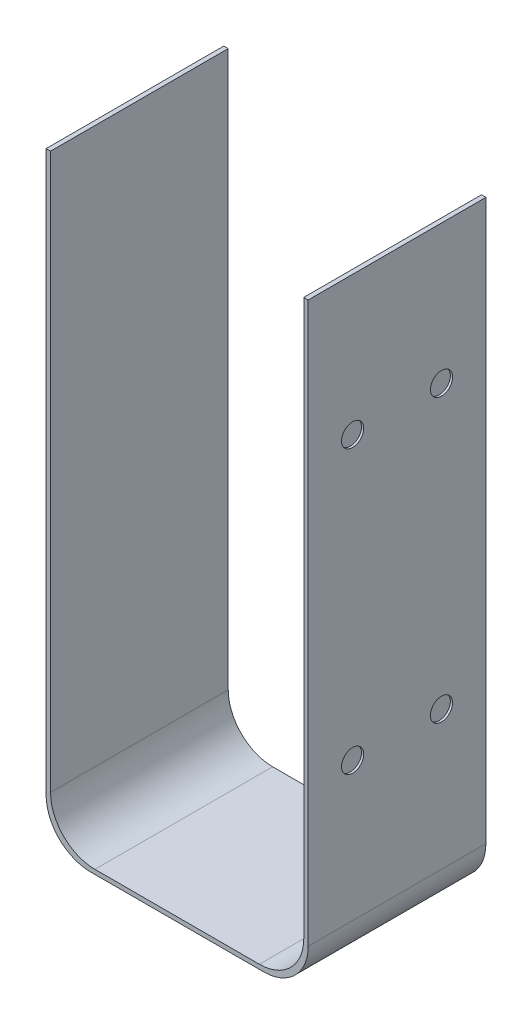
ISO-10303-21;
HEADER;
FILE_DESCRIPTION(('STEP AP214'),'2;1');
FILE_NAME('part.step','',(''),(''),'','','');
FILE_SCHEMA(('AUTOMOTIVE_DESIGN { 1 0 10303 214 1 1 1 1 }'));
ENDSEC;
DATA;
#1=APPLICATION_CONTEXT('core data for automotive mechanical design processes');
#2=APPLICATION_PROTOCOL_DEFINITION('international standard','automotive_design',2000,#1);
#3=PRODUCT_CONTEXT('',#1,'mechanical');
#4=PRODUCT('Part','Part','',(#3));
#5=PRODUCT_RELATED_PRODUCT_CATEGORY('part','',(#4));
#6=PRODUCT_DEFINITION_FORMATION('','',#4);
#7=PRODUCT_DEFINITION_CONTEXT('part definition',#1,'design');
#8=PRODUCT_DEFINITION('design','',#6,#7);
#9=PRODUCT_DEFINITION_SHAPE('','',#8);
#10=(LENGTH_UNIT() NAMED_UNIT(*) SI_UNIT(.MILLI.,.METRE.));
#11=(NAMED_UNIT(*) PLANE_ANGLE_UNIT() SI_UNIT($,.RADIAN.));
#12=(NAMED_UNIT(*) SI_UNIT($,.STERADIAN.) SOLID_ANGLE_UNIT());
#13=UNCERTAINTY_MEASURE_WITH_UNIT(LENGTH_MEASURE(1.E-05),#10,'distance_accuracy_value','');
#14=(GEOMETRIC_REPRESENTATION_CONTEXT(3) GLOBAL_UNCERTAINTY_ASSIGNED_CONTEXT((#13)) GLOBAL_UNIT_ASSIGNED_CONTEXT((#10,
#11,#12)) REPRESENTATION_CONTEXT('',''));
#15=CARTESIAN_POINT('',(0.,0.,0.));
#16=DIRECTION('',(0.,0.,1.));
#17=DIRECTION('',(1.,0.,0.));
#18=AXIS2_PLACEMENT_3D('',#15,#16,#17);
#19=CARTESIAN_POINT('',(-55.8801317233809,42.8642857142857,8.));
#20=DIRECTION('',(0.,-1.,0.));
#21=DIRECTION('',(0.,0.,-1.));
#22=AXIS2_PLACEMENT_3D('',#19,#20,#21);
#23=PLANE('',#22);
#24=DIRECTION('',(-1.,0.,0.));
#25=VECTOR('',#24,1.);
#26=CARTESIAN_POINT('',(-55.8801317233809,42.8642857142857,0.));
#27=LINE('',#26,#25);
#28=CARTESIAN_POINT('',(-55.6801317233809,42.8642857142857,0.));
#29=VERTEX_POINT('',#28);
#30=CARTESIAN_POINT('',(-55.8801317233809,42.8642857142857,0.));
#31=VERTEX_POINT('',#30);
#32=EDGE_CURVE('E153',#29,#31,#27,.T.);
#33=ORIENTED_EDGE('',*,*,#32,.T.);
#34=DIRECTION('',(0.,0.,-1.));
#35=VECTOR('',#34,1.);
#36=CARTESIAN_POINT('',(-55.8801317233809,42.8642857142857,8.));
#37=LINE('',#36,#35);
#38=CARTESIAN_POINT('',(-55.8801317233809,42.8642857142857,8.));
#39=VERTEX_POINT('',#38);
#40=EDGE_CURVE('E11',#39,#31,#37,.T.);
#41=ORIENTED_EDGE('',*,*,#40,.F.);
#42=DIRECTION('',(-1.,0.,0.));
#43=VECTOR('',#42,1.);
#44=CARTESIAN_POINT('',(-55.8801317233809,42.8642857142857,8.));
#45=LINE('',#44,#43);
#46=CARTESIAN_POINT('',(-55.6801317233809,42.8642857142857,8.));
#47=VERTEX_POINT('',#46);
#48=EDGE_CURVE('E176',#47,#39,#45,.T.);
#49=ORIENTED_EDGE('',*,*,#48,.F.);
#50=DIRECTION('',(0.,0.,-1.));
#51=VECTOR('',#50,1.);
#52=CARTESIAN_POINT('',(-55.6801317233809,42.8642857142857,8.));
#53=LINE('',#52,#51);
#54=EDGE_CURVE('E149',#47,#29,#53,.T.);
#55=ORIENTED_EDGE('',*,*,#54,.T.);
#56=EDGE_LOOP('',(#33,#41,#49,#55));
#57=FACE_BOUND('',#56,.T.);
#58=ADVANCED_FACE('F33',(#57),#23,.F.);
#59=CARTESIAN_POINT('',(-55.8801317233809,17.6642857142858,8.));
#60=DIRECTION('',(1.,0.,0.));
#61=DIRECTION('',(0.,0.,-1.));
#62=AXIS2_PLACEMENT_3D('',#59,#60,#61);
#63=PLANE('',#62);
#64=CARTESIAN_POINT('',(-55.8801317233809,36.6142857142857,6.));
#65=DIRECTION('',(-1.,0.,0.));
#66=DIRECTION('',(0.,0.,-1.));
#67=AXIS2_PLACEMENT_3D('',#64,#65,#66);
#68=CIRCLE('',#67,0.500000000000003);
#69=CARTESIAN_POINT('',(-55.8801317233809,36.6142857142857,5.5));
#70=VERTEX_POINT('',#69);
#71=EDGE_CURVE('E490',#70,#70,#68,.T.);
#72=ORIENTED_EDGE('',*,*,#71,.F.);
#73=EDGE_LOOP('',(#72));
#74=FACE_BOUND('',#73,.T.);
#75=CARTESIAN_POINT('',(-55.8801317233809,23.9142857142857,2.));
#76=DIRECTION('',(-1.,0.,0.));
#77=DIRECTION('',(0.,0.,-1.));
#78=AXIS2_PLACEMENT_3D('',#75,#76,#77);
#79=CIRCLE('',#78,0.500000000000003);
#80=CARTESIAN_POINT('',(-55.8801317233809,23.9142857142857,1.5));
#81=VERTEX_POINT('',#80);
#82=EDGE_CURVE('E489',#81,#81,#79,.T.);
#83=ORIENTED_EDGE('',*,*,#82,.F.);
#84=EDGE_LOOP('',(#83));
#85=FACE_BOUND('',#84,.T.);
#86=CARTESIAN_POINT('',(-55.8801317233809,23.9142857142857,6.));
#87=DIRECTION('',(-1.,0.,0.));
#88=DIRECTION('',(0.,0.,1.));
#89=AXIS2_PLACEMENT_3D('',#86,#87,#88);
#90=CIRCLE('',#89,0.500000000000003);
#91=CARTESIAN_POINT('',(-55.8801317233809,23.9142857142857,6.5));
#92=VERTEX_POINT('',#91);
#93=EDGE_CURVE('E551',#92,#92,#90,.T.);
#94=ORIENTED_EDGE('',*,*,#93,.F.);
#95=EDGE_LOOP('',(#94));
#96=FACE_BOUND('',#95,.T.);
#97=CARTESIAN_POINT('',(-55.8801317233809,36.6142857142857,2.));
#98=DIRECTION('',(-1.,0.,0.));
#99=DIRECTION('',(0.,0.,1.));
#100=AXIS2_PLACEMENT_3D('',#97,#98,#99);
#101=CIRCLE('',#100,0.500000000000003);
#102=CARTESIAN_POINT('',(-55.8801317233809,36.6142857142857,2.5));
#103=VERTEX_POINT('',#102);
#104=EDGE_CURVE('E503',#103,#103,#101,.T.);
#105=ORIENTED_EDGE('',*,*,#104,.F.);
#106=EDGE_LOOP('',(#105));
#107=FACE_BOUND('',#106,.T.);
#108=DIRECTION('',(0.,-1.,0.));
#109=VECTOR('',#108,1.);
#110=CARTESIAN_POINT('',(-55.8801317233809,17.6642857142858,0.));
#111=LINE('',#110,#109);
#112=CARTESIAN_POINT('',(-55.8801317233809,17.6642857142857,0.));
#113=VERTEX_POINT('',#112);
#114=EDGE_CURVE('E156',#31,#113,#111,.T.);
#115=ORIENTED_EDGE('',*,*,#114,.T.);
#116=DIRECTION('',(0.,0.,-1.));
#117=VECTOR('',#116,1.);
#118=CARTESIAN_POINT('',(-55.8801317233809,17.6642857142857,8.));
#119=LINE('',#118,#117);
#120=CARTESIAN_POINT('',(-55.8801317233809,17.6642857142857,8.));
#121=VERTEX_POINT('',#120);
#122=EDGE_CURVE('E41',#121,#113,#119,.T.);
#123=ORIENTED_EDGE('',*,*,#122,.F.);
#124=DIRECTION('',(0.,-1.,0.));
#125=VECTOR('',#124,1.);
#126=CARTESIAN_POINT('',(-55.8801317233809,17.6642857142858,8.));
#127=LINE('',#126,#125);
#128=EDGE_CURVE('E104',#39,#121,#127,.T.);
#129=ORIENTED_EDGE('',*,*,#128,.F.);
#130=ORIENTED_EDGE('',*,*,#40,.T.);
#131=EDGE_LOOP('',(#115,#123,#129,#130));
#132=FACE_BOUND('',#131,.T.);
#133=ADVANCED_FACE('F254',(#74,#85,#96,#107,#132),#63,.F.);
#134=CARTESIAN_POINT('',(-53.8801317233809,17.6642857142857,8.));
#135=DIRECTION('',(0.,0.,-1.));
#136=DIRECTION('',(-1.,0.,0.));
#137=AXIS2_PLACEMENT_3D('',#134,#135,#136);
#138=CYLINDRICAL_SURFACE('',#137,2.);
#139=CARTESIAN_POINT('',(-53.8801317233809,17.6642857142857,0.));
#140=DIRECTION('',(0.,0.,1.));
#141=DIRECTION('',(-1.,0.,0.));
#142=AXIS2_PLACEMENT_3D('',#139,#140,#141);
#143=CIRCLE('',#142,2.);
#144=CARTESIAN_POINT('',(-53.8801317233809,15.6642857142857,0.));
#145=VERTEX_POINT('',#144);
#146=EDGE_CURVE('E159',#113,#145,#143,.T.);
#147=ORIENTED_EDGE('',*,*,#146,.T.);
#148=DIRECTION('',(0.,0.,-1.));
#149=VECTOR('',#148,1.);
#150=CARTESIAN_POINT('',(-53.8801317233809,15.6642857142857,8.));
#151=LINE('',#150,#149);
#152=CARTESIAN_POINT('',(-53.8801317233809,15.6642857142857,8.));
#153=VERTEX_POINT('',#152);
#154=EDGE_CURVE('E195',#153,#145,#151,.T.);
#155=ORIENTED_EDGE('',*,*,#154,.F.);
#156=CARTESIAN_POINT('',(-53.8801317233809,17.6642857142857,8.));
#157=DIRECTION('',(0.,0.,1.));
#158=DIRECTION('',(-1.,0.,0.));
#159=AXIS2_PLACEMENT_3D('',#156,#157,#158);
#160=CIRCLE('',#159,2.);
#161=EDGE_CURVE('E203',#121,#153,#160,.T.);
#162=ORIENTED_EDGE('',*,*,#161,.F.);
#163=ORIENTED_EDGE('',*,*,#122,.T.);
#164=EDGE_LOOP('',(#147,#155,#162,#163));
#165=FACE_BOUND('',#164,.T.);
#166=ADVANCED_FACE('F201',(#165),#138,.T.);
#167=CARTESIAN_POINT('',(-46.0801317233809,15.6642857142857,8.));
#168=DIRECTION('',(0.,1.,0.));
#169=DIRECTION('',(0.,0.,1.));
#170=AXIS2_PLACEMENT_3D('',#167,#168,#169);
#171=PLANE('',#170);
#172=DIRECTION('',(1.,0.,0.));
#173=VECTOR('',#172,1.);
#174=CARTESIAN_POINT('',(-46.0801317233809,15.6642857142857,0.));
#175=LINE('',#174,#173);
#176=CARTESIAN_POINT('',(-46.0801317233809,15.6642857142857,0.));
#177=VERTEX_POINT('',#176);
#178=EDGE_CURVE('E161',#145,#177,#175,.T.);
#179=ORIENTED_EDGE('',*,*,#178,.T.);
#180=DIRECTION('',(0.,0.,-1.));
#181=VECTOR('',#180,1.);
#182=CARTESIAN_POINT('',(-46.0801317233809,15.6642857142857,8.));
#183=LINE('',#182,#181);
#184=CARTESIAN_POINT('',(-46.0801317233809,15.6642857142857,8.));
#185=VERTEX_POINT('',#184);
#186=EDGE_CURVE('E192',#185,#177,#183,.T.);
#187=ORIENTED_EDGE('',*,*,#186,.F.);
#188=DIRECTION('',(1.,0.,0.));
#189=VECTOR('',#188,1.);
#190=CARTESIAN_POINT('',(-46.0801317233809,15.6642857142857,8.));
#191=LINE('',#190,#189);
#192=EDGE_CURVE('E221',#153,#185,#191,.T.);
#193=ORIENTED_EDGE('',*,*,#192,.F.);
#194=ORIENTED_EDGE('',*,*,#154,.T.);
#195=EDGE_LOOP('',(#179,#187,#193,#194));
#196=FACE_BOUND('',#195,.T.);
#197=ADVANCED_FACE('F212',(#196),#171,.F.);
#198=CARTESIAN_POINT('',(-46.0801317233809,17.6642857142857,8.));
#199=DIRECTION('',(0.,0.,-1.));
#200=DIRECTION('',(-1.,0.,0.));
#201=AXIS2_PLACEMENT_3D('',#198,#199,#200);
#202=CYLINDRICAL_SURFACE('',#201,2.);
#203=CARTESIAN_POINT('',(-46.0801317233809,17.6642857142857,0.));
#204=DIRECTION('',(0.,0.,1.));
#205=DIRECTION('',(-1.,0.,0.));
#206=AXIS2_PLACEMENT_3D('',#203,#204,#205);
#207=CIRCLE('',#206,2.);
#208=CARTESIAN_POINT('',(-44.0801317233809,17.6642857142858,0.));
#209=VERTEX_POINT('',#208);
#210=EDGE_CURVE('E163',#177,#209,#207,.T.);
#211=ORIENTED_EDGE('',*,*,#210,.T.);
#212=DIRECTION('',(0.,0.,-1.));
#213=VECTOR('',#212,1.);
#214=CARTESIAN_POINT('',(-44.0801317233809,17.6642857142858,8.));
#215=LINE('',#214,#213);
#216=CARTESIAN_POINT('',(-44.0801317233809,17.6642857142858,8.));
#217=VERTEX_POINT('',#216);
#218=EDGE_CURVE('E189',#217,#209,#215,.T.);
#219=ORIENTED_EDGE('',*,*,#218,.F.);
#220=CARTESIAN_POINT('',(-46.0801317233809,17.6642857142857,8.));
#221=DIRECTION('',(0.,0.,1.));
#222=DIRECTION('',(-1.,0.,0.));
#223=AXIS2_PLACEMENT_3D('',#220,#221,#222);
#224=CIRCLE('',#223,2.);
#225=EDGE_CURVE('E218',#185,#217,#224,.T.);
#226=ORIENTED_EDGE('',*,*,#225,.F.);
#227=ORIENTED_EDGE('',*,*,#186,.T.);
#228=EDGE_LOOP('',(#211,#219,#226,#227));
#229=FACE_BOUND('',#228,.T.);
#230=ADVANCED_FACE('F216',(#229),#202,.T.);
#231=CARTESIAN_POINT('',(-44.0801317233809,42.8642857142857,8.));
#232=DIRECTION('',(-1.,0.,0.));
#233=DIRECTION('',(0.,0.,1.));
#234=AXIS2_PLACEMENT_3D('',#231,#232,#233);
#235=PLANE('',#234);
#236=CARTESIAN_POINT('',(-44.0801317233809,36.6142857142857,6.));
#237=DIRECTION('',(1.,0.,0.));
#238=DIRECTION('',(0.,0.,1.));
#239=AXIS2_PLACEMENT_3D('',#236,#237,#238);
#240=CIRCLE('',#239,0.500000000000001);
#241=CARTESIAN_POINT('',(-44.0801317233809,36.6142857142857,6.5));
#242=VERTEX_POINT('',#241);
#243=EDGE_CURVE('E502',#242,#242,#240,.T.);
#244=ORIENTED_EDGE('',*,*,#243,.F.);
#245=EDGE_LOOP('',(#244));
#246=FACE_BOUND('',#245,.T.);
#247=CARTESIAN_POINT('',(-44.0801317233809,23.9142857142857,2.));
#248=DIRECTION('',(1.,0.,0.));
#249=DIRECTION('',(0.,0.,1.));
#250=AXIS2_PLACEMENT_3D('',#247,#248,#249);
#251=CIRCLE('',#250,0.5);
#252=CARTESIAN_POINT('',(-44.0801317233809,23.9142857142857,2.5));
#253=VERTEX_POINT('',#252);
#254=EDGE_CURVE('E517',#253,#253,#251,.T.);
#255=ORIENTED_EDGE('',*,*,#254,.F.);
#256=EDGE_LOOP('',(#255));
#257=FACE_BOUND('',#256,.T.);
#258=CARTESIAN_POINT('',(-44.0801317233809,23.9142857142857,6.));
#259=DIRECTION('',(1.,0.,0.));
#260=DIRECTION('',(0.,0.,-1.));
#261=AXIS2_PLACEMENT_3D('',#258,#259,#260);
#262=CIRCLE('',#261,0.500000000000001);
#263=CARTESIAN_POINT('',(-44.0801317233809,23.9142857142857,5.5));
#264=VERTEX_POINT('',#263);
#265=EDGE_CURVE('E511',#264,#264,#262,.T.);
#266=ORIENTED_EDGE('',*,*,#265,.F.);
#267=EDGE_LOOP('',(#266));
#268=FACE_BOUND('',#267,.T.);
#269=CARTESIAN_POINT('',(-44.0801317233809,36.6142857142857,2.));
#270=DIRECTION('',(1.,0.,0.));
#271=DIRECTION('',(0.,0.,-1.));
#272=AXIS2_PLACEMENT_3D('',#269,#270,#271);
#273=CIRCLE('',#272,0.5);
#274=CARTESIAN_POINT('',(-44.0801317233809,36.6142857142857,1.5));
#275=VERTEX_POINT('',#274);
#276=EDGE_CURVE('E510',#275,#275,#273,.T.);
#277=ORIENTED_EDGE('',*,*,#276,.F.);
#278=EDGE_LOOP('',(#277));
#279=FACE_BOUND('',#278,.T.);
#280=DIRECTION('',(0.,1.,0.));
#281=VECTOR('',#280,1.);
#282=CARTESIAN_POINT('',(-44.0801317233809,42.8642857142857,0.));
#283=LINE('',#282,#281);
#284=CARTESIAN_POINT('',(-44.0801317233809,42.8642857142857,0.));
#285=VERTEX_POINT('',#284);
#286=EDGE_CURVE('E165',#209,#285,#283,.T.);
#287=ORIENTED_EDGE('',*,*,#286,.T.);
#288=DIRECTION('',(0.,0.,-1.));
#289=VECTOR('',#288,1.);
#290=CARTESIAN_POINT('',(-44.0801317233809,42.8642857142857,8.));
#291=LINE('',#290,#289);
#292=CARTESIAN_POINT('',(-44.0801317233809,42.8642857142857,8.));
#293=VERTEX_POINT('',#292);
#294=EDGE_CURVE('E186',#293,#285,#291,.T.);
#295=ORIENTED_EDGE('',*,*,#294,.F.);
#296=DIRECTION('',(0.,1.,0.));
#297=VECTOR('',#296,1.);
#298=CARTESIAN_POINT('',(-44.0801317233809,42.8642857142857,8.));
#299=LINE('',#298,#297);
#300=EDGE_CURVE('E220',#217,#293,#299,.T.);
#301=ORIENTED_EDGE('',*,*,#300,.F.);
#302=ORIENTED_EDGE('',*,*,#218,.T.);
#303=EDGE_LOOP('',(#287,#295,#301,#302));
#304=FACE_BOUND('',#303,.T.);
#305=ADVANCED_FACE('F270',(#246,#257,#268,#279,#304),#235,.F.);
#306=CARTESIAN_POINT('',(-44.2801317233809,42.8642857142857,8.));
#307=DIRECTION('',(0.,-1.,0.));
#308=DIRECTION('',(0.,0.,-1.));
#309=AXIS2_PLACEMENT_3D('',#306,#307,#308);
#310=PLANE('',#309);
#311=DIRECTION('',(-1.,0.,0.));
#312=VECTOR('',#311,1.);
#313=CARTESIAN_POINT('',(-44.2801317233809,42.8642857142857,0.));
#314=LINE('',#313,#312);
#315=CARTESIAN_POINT('',(-44.2801317233809,42.8642857142857,0.));
#316=VERTEX_POINT('',#315);
#317=EDGE_CURVE('E167',#285,#316,#314,.T.);
#318=ORIENTED_EDGE('',*,*,#317,.T.);
#319=DIRECTION('',(0.,0.,-1.));
#320=VECTOR('',#319,1.);
#321=CARTESIAN_POINT('',(-44.2801317233809,42.8642857142857,8.));
#322=LINE('',#321,#320);
#323=CARTESIAN_POINT('',(-44.2801317233809,42.8642857142857,8.));
#324=VERTEX_POINT('',#323);
#325=EDGE_CURVE('E183',#324,#316,#322,.T.);
#326=ORIENTED_EDGE('',*,*,#325,.F.);
#327=DIRECTION('',(-1.,0.,0.));
#328=VECTOR('',#327,1.);
#329=CARTESIAN_POINT('',(-44.2801317233809,42.8642857142857,8.));
#330=LINE('',#329,#328);
#331=EDGE_CURVE('E223',#293,#324,#330,.T.);
#332=ORIENTED_EDGE('',*,*,#331,.F.);
#333=ORIENTED_EDGE('',*,*,#294,.T.);
#334=EDGE_LOOP('',(#318,#326,#332,#333));
#335=FACE_BOUND('',#334,.T.);
#336=ADVANCED_FACE('F273',(#335),#310,.F.);
#337=CARTESIAN_POINT('',(-44.2801317233809,17.8642857142857,8.));
#338=DIRECTION('',(1.,0.,0.));
#339=DIRECTION('',(0.,0.,-1.));
#340=AXIS2_PLACEMENT_3D('',#337,#338,#339);
#341=PLANE('',#340);
#342=DIRECTION('',(0.,-1.,0.));
#343=VECTOR('',#342,1.);
#344=CARTESIAN_POINT('',(-44.2801317233809,17.8642857142857,0.));
#345=LINE('',#344,#343);
#346=CARTESIAN_POINT('',(-44.2801317233809,17.8642857142857,0.));
#347=VERTEX_POINT('',#346);
#348=EDGE_CURVE('E169',#316,#347,#345,.T.);
#349=ORIENTED_EDGE('',*,*,#348,.T.);
#350=DIRECTION('',(0.,0.,-1.));
#351=VECTOR('',#350,1.);
#352=CARTESIAN_POINT('',(-44.2801317233809,17.8642857142857,8.));
#353=LINE('',#352,#351);
#354=CARTESIAN_POINT('',(-44.2801317233809,17.8642857142857,8.));
#355=VERTEX_POINT('',#354);
#356=EDGE_CURVE('E180',#355,#347,#353,.T.);
#357=ORIENTED_EDGE('',*,*,#356,.F.);
#358=DIRECTION('',(0.,-1.,0.));
#359=VECTOR('',#358,1.);
#360=CARTESIAN_POINT('',(-44.2801317233809,17.8642857142857,8.));
#361=LINE('',#360,#359);
#362=EDGE_CURVE('E229',#324,#355,#361,.T.);
#363=ORIENTED_EDGE('',*,*,#362,.F.);
#364=ORIENTED_EDGE('',*,*,#325,.T.);
#365=EDGE_LOOP('',(#349,#357,#363,#364));
#366=FACE_BOUND('',#365,.T.);
#367=ADVANCED_FACE('F235',(#366),#341,.F.);
#368=CARTESIAN_POINT('',(-46.2801317233809,17.8642857142857,8.));
#369=DIRECTION('',(0.,0.,-1.));
#370=DIRECTION('',(-1.,0.,0.));
#371=AXIS2_PLACEMENT_3D('',#368,#369,#370);
#372=CYLINDRICAL_SURFACE('',#371,2.);
#373=CARTESIAN_POINT('',(-46.2801317233809,17.8642857142857,0.));
#374=DIRECTION('',(0.,0.,-1.));
#375=DIRECTION('',(-1.,0.,0.));
#376=AXIS2_PLACEMENT_3D('',#373,#374,#375);
#377=CIRCLE('',#376,2.);
#378=CARTESIAN_POINT('',(-46.2801317233809,15.8642857142857,0.));
#379=VERTEX_POINT('',#378);
#380=EDGE_CURVE('E171',#347,#379,#377,.T.);
#381=ORIENTED_EDGE('',*,*,#380,.T.);
#382=DIRECTION('',(0.,0.,-1.));
#383=VECTOR('',#382,1.);
#384=CARTESIAN_POINT('',(-46.2801317233809,15.8642857142857,8.));
#385=LINE('',#384,#383);
#386=CARTESIAN_POINT('',(-46.2801317233809,15.8642857142857,8.));
#387=VERTEX_POINT('',#386);
#388=EDGE_CURVE('E144',#387,#379,#385,.T.);
#389=ORIENTED_EDGE('',*,*,#388,.F.);
#390=CARTESIAN_POINT('',(-46.2801317233809,17.8642857142857,8.));
#391=DIRECTION('',(0.,0.,-1.));
#392=DIRECTION('',(-1.,0.,0.));
#393=AXIS2_PLACEMENT_3D('',#390,#391,#392);
#394=CIRCLE('',#393,2.);
#395=EDGE_CURVE('E135',#355,#387,#394,.T.);
#396=ORIENTED_EDGE('',*,*,#395,.F.);
#397=ORIENTED_EDGE('',*,*,#356,.T.);
#398=EDGE_LOOP('',(#381,#389,#396,#397));
#399=FACE_BOUND('',#398,.T.);
#400=ADVANCED_FACE('F239',(#399),#372,.F.);
#401=CARTESIAN_POINT('',(-53.6801317233809,15.8642857142857,8.));
#402=DIRECTION('',(0.,-1.,0.));
#403=DIRECTION('',(0.,0.,-1.));
#404=AXIS2_PLACEMENT_3D('',#401,#402,#403);
#405=PLANE('',#404);
#406=DIRECTION('',(-1.,0.,0.));
#407=VECTOR('',#406,1.);
#408=CARTESIAN_POINT('',(-53.6801317233809,15.8642857142857,0.));
#409=LINE('',#408,#407);
#410=CARTESIAN_POINT('',(-53.6801317233809,15.8642857142857,0.));
#411=VERTEX_POINT('',#410);
#412=EDGE_CURVE('E143',#379,#411,#409,.T.);
#413=ORIENTED_EDGE('',*,*,#412,.T.);
#414=DIRECTION('',(0.,0.,-1.));
#415=VECTOR('',#414,1.);
#416=CARTESIAN_POINT('',(-53.6801317233809,15.8642857142857,8.));
#417=LINE('',#416,#415);
#418=CARTESIAN_POINT('',(-53.6801317233809,15.8642857142857,8.));
#419=VERTEX_POINT('',#418);
#420=EDGE_CURVE('E140',#419,#411,#417,.T.);
#421=ORIENTED_EDGE('',*,*,#420,.F.);
#422=DIRECTION('',(-1.,0.,0.));
#423=VECTOR('',#422,1.);
#424=CARTESIAN_POINT('',(-53.6801317233809,15.8642857142857,8.));
#425=LINE('',#424,#423);
#426=EDGE_CURVE('E129',#387,#419,#425,.T.);
#427=ORIENTED_EDGE('',*,*,#426,.F.);
#428=ORIENTED_EDGE('',*,*,#388,.T.);
#429=EDGE_LOOP('',(#413,#421,#427,#428));
#430=FACE_BOUND('',#429,.T.);
#431=ADVANCED_FACE('F141',(#430),#405,.F.);
#432=CARTESIAN_POINT('',(-53.6801317233809,17.8642857142857,8.));
#433=DIRECTION('',(0.,0.,-1.));
#434=DIRECTION('',(-1.,0.,0.));
#435=AXIS2_PLACEMENT_3D('',#432,#433,#434);
#436=CYLINDRICAL_SURFACE('',#435,2.);
#437=CARTESIAN_POINT('',(-53.6801317233809,17.8642857142857,0.));
#438=DIRECTION('',(0.,0.,-1.));
#439=DIRECTION('',(-1.,0.,0.));
#440=AXIS2_PLACEMENT_3D('',#437,#438,#439);
#441=CIRCLE('',#440,2.);
#442=CARTESIAN_POINT('',(-55.6801317233809,17.8642857142857,0.));
#443=VERTEX_POINT('',#442);
#444=EDGE_CURVE('E90',#411,#443,#441,.T.);
#445=ORIENTED_EDGE('',*,*,#444,.T.);
#446=DIRECTION('',(0.,0.,-1.));
#447=VECTOR('',#446,1.);
#448=CARTESIAN_POINT('',(-55.6801317233809,17.8642857142857,8.));
#449=LINE('',#448,#447);
#450=CARTESIAN_POINT('',(-55.6801317233809,17.8642857142857,8.));
#451=VERTEX_POINT('',#450);
#452=EDGE_CURVE('E145',#451,#443,#449,.T.);
#453=ORIENTED_EDGE('',*,*,#452,.F.);
#454=CARTESIAN_POINT('',(-53.6801317233809,17.8642857142857,8.));
#455=DIRECTION('',(0.,0.,-1.));
#456=DIRECTION('',(-1.,0.,0.));
#457=AXIS2_PLACEMENT_3D('',#454,#455,#456);
#458=CIRCLE('',#457,2.);
#459=EDGE_CURVE('E133',#419,#451,#458,.T.);
#460=ORIENTED_EDGE('',*,*,#459,.F.);
#461=ORIENTED_EDGE('',*,*,#420,.T.);
#462=EDGE_LOOP('',(#445,#453,#460,#461));
#463=FACE_BOUND('',#462,.T.);
#464=ADVANCED_FACE('F147',(#463),#436,.F.);
#465=CARTESIAN_POINT('',(-55.6801317233809,42.8642857142857,8.));
#466=DIRECTION('',(-1.,0.,0.));
#467=DIRECTION('',(0.,0.,1.));
#468=AXIS2_PLACEMENT_3D('',#465,#466,#467);
#469=PLANE('',#468);
#470=DIRECTION('',(0.,1.,0.));
#471=VECTOR('',#470,1.);
#472=CARTESIAN_POINT('',(-55.6801317233809,42.8642857142857,0.));
#473=LINE('',#472,#471);
#474=EDGE_CURVE('E96',#443,#29,#473,.T.);
#475=ORIENTED_EDGE('',*,*,#474,.T.);
#476=ORIENTED_EDGE('',*,*,#54,.F.);
#477=DIRECTION('',(0.,1.,0.));
#478=VECTOR('',#477,1.);
#479=CARTESIAN_POINT('',(-55.6801317233809,42.8642857142857,8.));
#480=LINE('',#479,#478);
#481=EDGE_CURVE('E49',#451,#47,#480,.T.);
#482=ORIENTED_EDGE('',*,*,#481,.F.);
#483=ORIENTED_EDGE('',*,*,#452,.T.);
#484=EDGE_LOOP('',(#475,#476,#482,#483));
#485=FACE_BOUND('',#484,.T.);
#486=ADVANCED_FACE('F243',(#485),#469,.F.);
#487=CARTESIAN_POINT('',(-53.6801317233809,17.8642857142857,8.));
#488=DIRECTION('',(0.,0.,-1.));
#489=DIRECTION('',(-1.,0.,0.));
#490=AXIS2_PLACEMENT_3D('',#487,#488,#489);
#491=PLANE('',#490);
#492=ORIENTED_EDGE('',*,*,#48,.T.);
#493=ORIENTED_EDGE('',*,*,#128,.T.);
#494=ORIENTED_EDGE('',*,*,#161,.T.);
#495=ORIENTED_EDGE('',*,*,#192,.T.);
#496=ORIENTED_EDGE('',*,*,#225,.T.);
#497=ORIENTED_EDGE('',*,*,#300,.T.);
#498=ORIENTED_EDGE('',*,*,#331,.T.);
#499=ORIENTED_EDGE('',*,*,#362,.T.);
#500=ORIENTED_EDGE('',*,*,#395,.T.);
#501=ORIENTED_EDGE('',*,*,#426,.T.);
#502=ORIENTED_EDGE('',*,*,#459,.T.);
#503=ORIENTED_EDGE('',*,*,#481,.T.);
#504=EDGE_LOOP('',(#492,#493,#494,#495,#496,#497,#498,#499,#500,#501,#502,#503));
#505=FACE_BOUND('',#504,.T.);
#506=ADVANCED_FACE('F131',(#505),#491,.F.);
#507=CARTESIAN_POINT('',(-53.6801317233809,17.8642857142857,0.));
#508=DIRECTION('',(0.,0.,-1.));
#509=DIRECTION('',(-1.,0.,0.));
#510=AXIS2_PLACEMENT_3D('',#507,#508,#509);
#511=PLANE('',#510);
#512=ORIENTED_EDGE('',*,*,#32,.F.);
#513=ORIENTED_EDGE('',*,*,#474,.F.);
#514=ORIENTED_EDGE('',*,*,#444,.F.);
#515=ORIENTED_EDGE('',*,*,#412,.F.);
#516=ORIENTED_EDGE('',*,*,#380,.F.);
#517=ORIENTED_EDGE('',*,*,#348,.F.);
#518=ORIENTED_EDGE('',*,*,#317,.F.);
#519=ORIENTED_EDGE('',*,*,#286,.F.);
#520=ORIENTED_EDGE('',*,*,#210,.F.);
#521=ORIENTED_EDGE('',*,*,#178,.F.);
#522=ORIENTED_EDGE('',*,*,#146,.F.);
#523=ORIENTED_EDGE('',*,*,#114,.F.);
#524=EDGE_LOOP('',(#512,#513,#514,#515,#516,#517,#518,#519,#520,#521,#522,#523));
#525=FACE_BOUND('',#524,.T.);
#526=ADVANCED_FACE('F207',(#525),#511,.T.);
#527=CARTESIAN_POINT('',(-44.1801317233809,36.6142857142857,2.));
#528=DIRECTION('',(1.,0.,0.));
#529=DIRECTION('',(0.,0.,-1.));
#530=AXIS2_PLACEMENT_3D('',#527,#528,#529);
#531=CYLINDRICAL_SURFACE('',#530,0.5);
#532=CARTESIAN_POINT('',(-44.1801317233809,36.6142857142857,2.));
#533=DIRECTION('',(1.,0.,0.));
#534=DIRECTION('',(0.,0.,-1.));
#535=AXIS2_PLACEMENT_3D('',#532,#533,#534);
#536=CIRCLE('',#535,0.5);
#537=CARTESIAN_POINT('',(-44.1801317233809,36.6142857142857,1.5));
#538=VERTEX_POINT('',#537);
#539=EDGE_CURVE('E157',#538,#538,#536,.T.);
#540=ORIENTED_EDGE('',*,*,#539,.F.);
#541=EDGE_LOOP('',(#540));
#542=FACE_BOUND('',#541,.T.);
#543=ORIENTED_EDGE('',*,*,#276,.T.);
#544=EDGE_LOOP('',(#543));
#545=FACE_BOUND('',#544,.T.);
#546=ADVANCED_FACE('F310',(#542,#545),#531,.F.);
#547=CARTESIAN_POINT('',(-44.1801317233809,36.6142857142857,2.));
#548=DIRECTION('',(1.,0.,0.));
#549=DIRECTION('',(0.,0.,-1.));
#550=AXIS2_PLACEMENT_3D('',#547,#548,#549);
#551=PLANE('',#550);
#552=ORIENTED_EDGE('',*,*,#539,.T.);
#553=EDGE_LOOP('',(#552));
#554=FACE_BOUND('',#553,.T.);
#555=ADVANCED_FACE('F326',(#554),#551,.T.);
#556=CARTESIAN_POINT('',(-44.1801317233809,23.9142857142857,6.));
#557=DIRECTION('',(1.,0.,0.));
#558=DIRECTION('',(0.,0.,-1.));
#559=AXIS2_PLACEMENT_3D('',#556,#557,#558);
#560=CYLINDRICAL_SURFACE('',#559,0.500000000000001);
#561=CARTESIAN_POINT('',(-44.1801317233809,23.9142857142857,6.));
#562=DIRECTION('',(1.,0.,0.));
#563=DIRECTION('',(0.,0.,-1.));
#564=AXIS2_PLACEMENT_3D('',#561,#562,#563);
#565=CIRCLE('',#564,0.500000000000001);
#566=CARTESIAN_POINT('',(-44.1801317233809,23.9142857142857,5.5));
#567=VERTEX_POINT('',#566);
#568=EDGE_CURVE('E507',#567,#567,#565,.T.);
#569=ORIENTED_EDGE('',*,*,#568,.F.);
#570=EDGE_LOOP('',(#569));
#571=FACE_BOUND('',#570,.T.);
#572=ORIENTED_EDGE('',*,*,#265,.T.);
#573=EDGE_LOOP('',(#572));
#574=FACE_BOUND('',#573,.T.);
#575=ADVANCED_FACE('F336',(#571,#574),#560,.F.);
#576=CARTESIAN_POINT('',(-44.1801317233809,23.9142857142857,6.));
#577=DIRECTION('',(1.,0.,0.));
#578=DIRECTION('',(0.,0.,-1.));
#579=AXIS2_PLACEMENT_3D('',#576,#577,#578);
#580=PLANE('',#579);
#581=ORIENTED_EDGE('',*,*,#568,.T.);
#582=EDGE_LOOP('',(#581));
#583=FACE_BOUND('',#582,.T.);
#584=ADVANCED_FACE('F346',(#583),#580,.T.);
#585=CARTESIAN_POINT('',(-44.1801317233809,23.9142857142857,2.));
#586=DIRECTION('',(1.,0.,0.));
#587=DIRECTION('',(0.,0.,-1.));
#588=AXIS2_PLACEMENT_3D('',#585,#586,#587);
#589=CYLINDRICAL_SURFACE('',#588,0.5);
#590=CARTESIAN_POINT('',(-44.1801317233809,23.9142857142857,2.));
#591=DIRECTION('',(1.,0.,0.));
#592=DIRECTION('',(0.,0.,1.));
#593=AXIS2_PLACEMENT_3D('',#590,#591,#592);
#594=CIRCLE('',#593,0.5);
#595=CARTESIAN_POINT('',(-44.1801317233809,23.9142857142857,2.5));
#596=VERTEX_POINT('',#595);
#597=EDGE_CURVE('E514',#596,#596,#594,.T.);
#598=ORIENTED_EDGE('',*,*,#597,.F.);
#599=EDGE_LOOP('',(#598));
#600=FACE_BOUND('',#599,.T.);
#601=ORIENTED_EDGE('',*,*,#254,.T.);
#602=EDGE_LOOP('',(#601));
#603=FACE_BOUND('',#602,.T.);
#604=ADVANCED_FACE('F356',(#600,#603),#589,.F.);
#605=CARTESIAN_POINT('',(-44.1801317233809,23.9142857142857,2.));
#606=DIRECTION('',(-1.,0.,0.));
#607=DIRECTION('',(0.,0.,1.));
#608=AXIS2_PLACEMENT_3D('',#605,#606,#607);
#609=PLANE('',#608);
#610=ORIENTED_EDGE('',*,*,#597,.T.);
#611=EDGE_LOOP('',(#610));
#612=FACE_BOUND('',#611,.T.);
#613=ADVANCED_FACE('F366',(#612),#609,.F.);
#614=CARTESIAN_POINT('',(-44.1801317233809,36.6142857142857,6.));
#615=DIRECTION('',(1.,0.,0.));
#616=DIRECTION('',(0.,0.,-1.));
#617=AXIS2_PLACEMENT_3D('',#614,#615,#616);
#618=CYLINDRICAL_SURFACE('',#617,0.500000000000001);
#619=CARTESIAN_POINT('',(-44.1801317233809,36.6142857142857,6.));
#620=DIRECTION('',(1.,0.,0.));
#621=DIRECTION('',(0.,0.,1.));
#622=AXIS2_PLACEMENT_3D('',#619,#620,#621);
#623=CIRCLE('',#622,0.500000000000001);
#624=CARTESIAN_POINT('',(-44.1801317233809,36.6142857142857,6.5));
#625=VERTEX_POINT('',#624);
#626=EDGE_CURVE('E520',#625,#625,#623,.T.);
#627=ORIENTED_EDGE('',*,*,#626,.F.);
#628=EDGE_LOOP('',(#627));
#629=FACE_BOUND('',#628,.T.);
#630=ORIENTED_EDGE('',*,*,#243,.T.);
#631=EDGE_LOOP('',(#630));
#632=FACE_BOUND('',#631,.T.);
#633=ADVANCED_FACE('F376',(#629,#632),#618,.F.);
#634=CARTESIAN_POINT('',(-44.1801317233809,36.6142857142857,6.));
#635=DIRECTION('',(-1.,0.,0.));
#636=DIRECTION('',(0.,0.,1.));
#637=AXIS2_PLACEMENT_3D('',#634,#635,#636);
#638=PLANE('',#637);
#639=ORIENTED_EDGE('',*,*,#626,.T.);
#640=EDGE_LOOP('',(#639));
#641=FACE_BOUND('',#640,.T.);
#642=ADVANCED_FACE('F386',(#641),#638,.F.);
#643=CARTESIAN_POINT('',(-55.7801317233809,36.6142857142857,2.));
#644=DIRECTION('',(-1.,0.,0.));
#645=DIRECTION('',(0.,0.,1.));
#646=AXIS2_PLACEMENT_3D('',#643,#644,#645);
#647=CYLINDRICAL_SURFACE('',#646,0.500000000000003);
#648=CARTESIAN_POINT('',(-55.7801317233809,36.6142857142857,2.));
#649=DIRECTION('',(-1.,0.,0.));
#650=DIRECTION('',(0.,0.,1.));
#651=AXIS2_PLACEMENT_3D('',#648,#649,#650);
#652=CIRCLE('',#651,0.500000000000003);
#653=CARTESIAN_POINT('',(-55.7801317233809,36.6142857142857,2.5));
#654=VERTEX_POINT('',#653);
#655=EDGE_CURVE('E499',#654,#654,#652,.T.);
#656=ORIENTED_EDGE('',*,*,#655,.F.);
#657=EDGE_LOOP('',(#656));
#658=FACE_BOUND('',#657,.T.);
#659=ORIENTED_EDGE('',*,*,#104,.T.);
#660=EDGE_LOOP('',(#659));
#661=FACE_BOUND('',#660,.T.);
#662=ADVANCED_FACE('F395',(#658,#661),#647,.F.);
#663=CARTESIAN_POINT('',(-55.7801317233809,36.6142857142857,2.));
#664=DIRECTION('',(-1.,0.,0.));
#665=DIRECTION('',(0.,0.,1.));
#666=AXIS2_PLACEMENT_3D('',#663,#664,#665);
#667=PLANE('',#666);
#668=ORIENTED_EDGE('',*,*,#655,.T.);
#669=EDGE_LOOP('',(#668));
#670=FACE_BOUND('',#669,.T.);
#671=ADVANCED_FACE('F412',(#670),#667,.T.);
#672=CARTESIAN_POINT('',(-55.7801317233809,23.9142857142857,6.));
#673=DIRECTION('',(-1.,0.,0.));
#674=DIRECTION('',(0.,0.,1.));
#675=AXIS2_PLACEMENT_3D('',#672,#673,#674);
#676=CYLINDRICAL_SURFACE('',#675,0.500000000000003);
#677=CARTESIAN_POINT('',(-55.7801317233809,23.9142857142857,6.));
#678=DIRECTION('',(-1.,0.,0.));
#679=DIRECTION('',(0.,0.,1.));
#680=AXIS2_PLACEMENT_3D('',#677,#678,#679);
#681=CIRCLE('',#680,0.500000000000003);
#682=CARTESIAN_POINT('',(-55.7801317233809,23.9142857142857,6.5));
#683=VERTEX_POINT('',#682);
#684=EDGE_CURVE('E506',#683,#683,#681,.T.);
#685=ORIENTED_EDGE('',*,*,#684,.F.);
#686=EDGE_LOOP('',(#685));
#687=FACE_BOUND('',#686,.T.);
#688=ORIENTED_EDGE('',*,*,#93,.T.);
#689=EDGE_LOOP('',(#688));
#690=FACE_BOUND('',#689,.T.);
#691=ADVANCED_FACE('F422',(#687,#690),#676,.F.);
#692=CARTESIAN_POINT('',(-55.7801317233809,23.9142857142857,6.));
#693=DIRECTION('',(-1.,0.,0.));
#694=DIRECTION('',(0.,0.,1.));
#695=AXIS2_PLACEMENT_3D('',#692,#693,#694);
#696=PLANE('',#695);
#697=ORIENTED_EDGE('',*,*,#684,.T.);
#698=EDGE_LOOP('',(#697));
#699=FACE_BOUND('',#698,.T.);
#700=ADVANCED_FACE('F432',(#699),#696,.T.);
#701=CARTESIAN_POINT('',(-55.7801317233809,23.9142857142857,2.));
#702=DIRECTION('',(-1.,0.,0.));
#703=DIRECTION('',(0.,0.,1.));
#704=AXIS2_PLACEMENT_3D('',#701,#702,#703);
#705=CYLINDRICAL_SURFACE('',#704,0.500000000000003);
#706=CARTESIAN_POINT('',(-55.7801317233809,23.9142857142857,2.));
#707=DIRECTION('',(-1.,0.,0.));
#708=DIRECTION('',(0.,0.,-1.));
#709=AXIS2_PLACEMENT_3D('',#706,#707,#708);
#710=CIRCLE('',#709,0.500000000000003);
#711=CARTESIAN_POINT('',(-55.7801317233809,23.9142857142857,1.5));
#712=VERTEX_POINT('',#711);
#713=EDGE_CURVE('E493',#712,#712,#710,.T.);
#714=ORIENTED_EDGE('',*,*,#713,.F.);
#715=EDGE_LOOP('',(#714));
#716=FACE_BOUND('',#715,.T.);
#717=ORIENTED_EDGE('',*,*,#82,.T.);
#718=EDGE_LOOP('',(#717));
#719=FACE_BOUND('',#718,.T.);
#720=ADVANCED_FACE('F442',(#716,#719),#705,.F.);
#721=CARTESIAN_POINT('',(-55.7801317233809,23.9142857142857,2.));
#722=DIRECTION('',(1.,0.,0.));
#723=DIRECTION('',(0.,0.,-1.));
#724=AXIS2_PLACEMENT_3D('',#721,#722,#723);
#725=PLANE('',#724);
#726=ORIENTED_EDGE('',*,*,#713,.T.);
#727=EDGE_LOOP('',(#726));
#728=FACE_BOUND('',#727,.T.);
#729=ADVANCED_FACE('F452',(#728),#725,.F.);
#730=CARTESIAN_POINT('',(-55.7801317233809,36.6142857142857,6.));
#731=DIRECTION('',(-1.,0.,0.));
#732=DIRECTION('',(0.,0.,1.));
#733=AXIS2_PLACEMENT_3D('',#730,#731,#732);
#734=CYLINDRICAL_SURFACE('',#733,0.500000000000003);
#735=CARTESIAN_POINT('',(-55.7801317233809,36.6142857142857,6.));
#736=DIRECTION('',(-1.,0.,0.));
#737=DIRECTION('',(0.,0.,-1.));
#738=AXIS2_PLACEMENT_3D('',#735,#736,#737);
#739=CIRCLE('',#738,0.500000000000003);
#740=CARTESIAN_POINT('',(-55.7801317233809,36.6142857142857,5.5));
#741=VERTEX_POINT('',#740);
#742=EDGE_CURVE('E488',#741,#741,#739,.T.);
#743=ORIENTED_EDGE('',*,*,#742,.F.);
#744=EDGE_LOOP('',(#743));
#745=FACE_BOUND('',#744,.T.);
#746=ORIENTED_EDGE('',*,*,#71,.T.);
#747=EDGE_LOOP('',(#746));
#748=FACE_BOUND('',#747,.T.);
#749=ADVANCED_FACE('F462',(#745,#748),#734,.F.);
#750=CARTESIAN_POINT('',(-55.7801317233809,36.6142857142857,6.));
#751=DIRECTION('',(1.,0.,0.));
#752=DIRECTION('',(0.,0.,-1.));
#753=AXIS2_PLACEMENT_3D('',#750,#751,#752);
#754=PLANE('',#753);
#755=ORIENTED_EDGE('',*,*,#742,.T.);
#756=EDGE_LOOP('',(#755));
#757=FACE_BOUND('',#756,.T.);
#758=ADVANCED_FACE('F472',(#757),#754,.F.);
#759=CLOSED_SHELL('',(#58,#133,#166,#197,#230,#305,#336,#367,#400,#431,#464,#486,#506,#526,#546,
#555,#575,#584,#604,#613,#633,#642,#662,#671,#691,#700,#720,#729,#749,#758));
#760=MANIFOLD_SOLID_BREP('B2',#759);
#761=ADVANCED_BREP_SHAPE_REPRESENTATION('',(#18,#760),#14);
#762=SHAPE_DEFINITION_REPRESENTATION(#9,#761);
ENDSEC;
END-ISO-10303-21;
